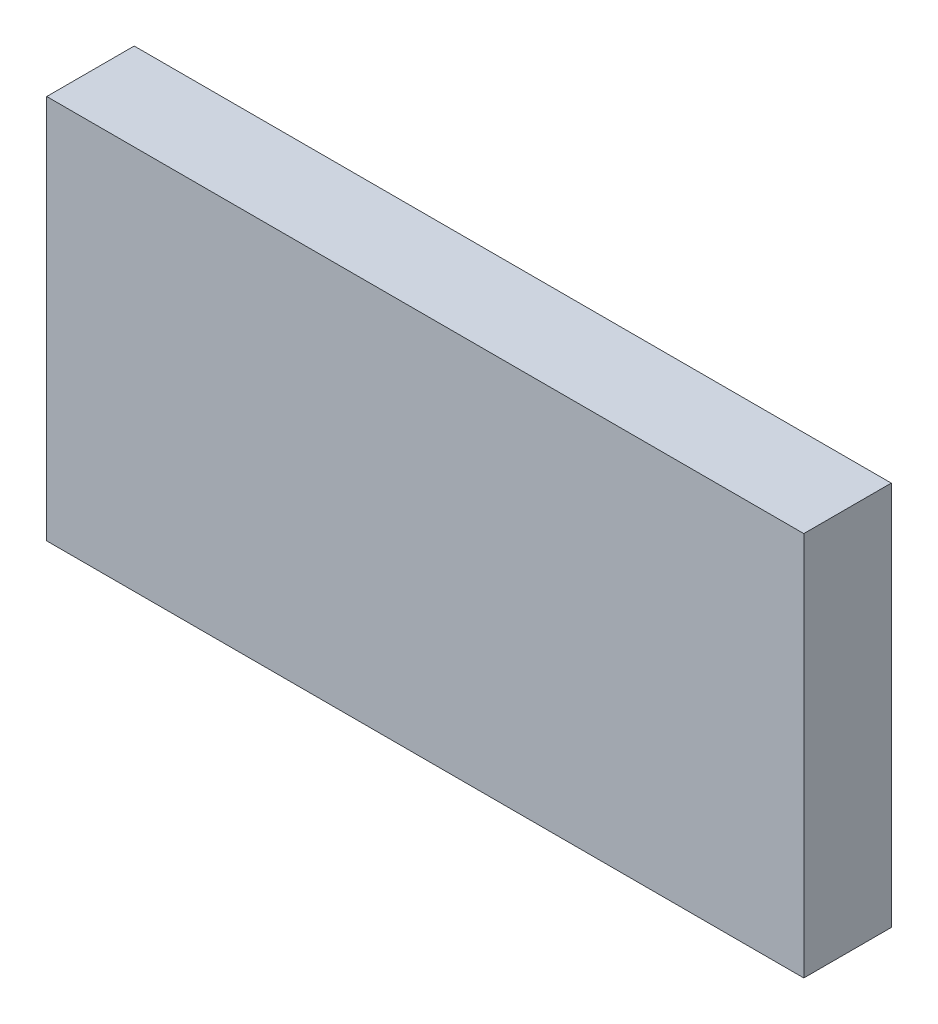
ISO-10303-21;
HEADER;
FILE_DESCRIPTION(('STEP AP214'),'2;1');
FILE_NAME('part.step','',(''),(''),'','','');
FILE_SCHEMA(('AUTOMOTIVE_DESIGN { 1 0 10303 214 1 1 1 1 }'));
ENDSEC;
DATA;
#1=APPLICATION_CONTEXT('core data for automotive mechanical design processes');
#2=APPLICATION_PROTOCOL_DEFINITION('international standard','automotive_design',2000,#1);
#3=PRODUCT_CONTEXT('',#1,'mechanical');
#4=PRODUCT('Part','Part','',(#3));
#5=PRODUCT_RELATED_PRODUCT_CATEGORY('part','',(#4));
#6=PRODUCT_DEFINITION_FORMATION('','',#4);
#7=PRODUCT_DEFINITION_CONTEXT('part definition',#1,'design');
#8=PRODUCT_DEFINITION('design','',#6,#7);
#9=PRODUCT_DEFINITION_SHAPE('','',#8);
#10=(LENGTH_UNIT() NAMED_UNIT(*) SI_UNIT(.MILLI.,.METRE.));
#11=(NAMED_UNIT(*) PLANE_ANGLE_UNIT() SI_UNIT($,.RADIAN.));
#12=(NAMED_UNIT(*) SI_UNIT($,.STERADIAN.) SOLID_ANGLE_UNIT());
#13=UNCERTAINTY_MEASURE_WITH_UNIT(LENGTH_MEASURE(1.E-05),#10,'distance_accuracy_value','');
#14=(GEOMETRIC_REPRESENTATION_CONTEXT(3) GLOBAL_UNCERTAINTY_ASSIGNED_CONTEXT((#13)) GLOBAL_UNIT_ASSIGNED_CONTEXT((#10,
#11,#12)) REPRESENTATION_CONTEXT('',''));
#15=CARTESIAN_POINT('',(0.,0.,0.));
#16=DIRECTION('',(0.,0.,1.));
#17=DIRECTION('',(1.,0.,0.));
#18=AXIS2_PLACEMENT_3D('',#15,#16,#17);
#19=CARTESIAN_POINT('',(0.5795,-0.62,0.));
#20=DIRECTION('',(1.,0.,0.));
#21=DIRECTION('',(0.,0.,1.));
#22=AXIS2_PLACEMENT_3D('',#19,#20,#21);
#23=PLANE('',#22);
#24=DIRECTION('',(0.,1.,0.));
#25=VECTOR('',#24,1.);
#26=CARTESIAN_POINT('',(0.5795,-0.62,0.1));
#27=LINE('',#26,#25);
#28=CARTESIAN_POINT('',(0.5795,-0.62,0.1));
#29=VERTEX_POINT('',#28);
#30=CARTESIAN_POINT('',(0.5795,-0.18,0.1));
#31=VERTEX_POINT('',#30);
#32=EDGE_CURVE('E11',#29,#31,#27,.T.);
#33=ORIENTED_EDGE('',*,*,#32,.T.);
#34=DIRECTION('',(0.,0.,1.));
#35=VECTOR('',#34,1.);
#36=CARTESIAN_POINT('',(0.5795,-0.18,0.));
#37=LINE('',#36,#35);
#38=CARTESIAN_POINT('',(0.5795,-0.18,0.));
#39=VERTEX_POINT('',#38);
#40=EDGE_CURVE('E24',#39,#31,#37,.T.);
#41=ORIENTED_EDGE('',*,*,#40,.F.);
#42=DIRECTION('',(0.,1.,0.));
#43=VECTOR('',#42,1.);
#44=CARTESIAN_POINT('',(0.5795,-0.62,0.));
#45=LINE('',#44,#43);
#46=CARTESIAN_POINT('',(0.5795,-0.62,0.));
#47=VERTEX_POINT('',#46);
#48=EDGE_CURVE('E86',#47,#39,#45,.T.);
#49=ORIENTED_EDGE('',*,*,#48,.F.);
#50=DIRECTION('',(0.,0.,1.));
#51=VECTOR('',#50,1.);
#52=CARTESIAN_POINT('',(0.5795,-0.62,0.));
#53=LINE('',#52,#51);
#54=EDGE_CURVE('E36',#47,#29,#53,.T.);
#55=ORIENTED_EDGE('',*,*,#54,.T.);
#56=EDGE_LOOP('',(#33,#41,#49,#55));
#57=FACE_BOUND('',#56,.T.);
#58=ADVANCED_FACE('F17',(#57),#23,.F.);
#59=CARTESIAN_POINT('',(1.445,-0.62,0.));
#60=DIRECTION('',(1.,0.,0.));
#61=DIRECTION('',(0.,0.,1.));
#62=AXIS2_PLACEMENT_3D('',#59,#60,#61);
#63=PLANE('',#62);
#64=DIRECTION('',(0.,0.,1.));
#65=VECTOR('',#64,1.);
#66=CARTESIAN_POINT('',(1.445,-0.62,0.));
#67=LINE('',#66,#65);
#68=CARTESIAN_POINT('',(1.445,-0.62,0.));
#69=VERTEX_POINT('',#68);
#70=CARTESIAN_POINT('',(1.445,-0.62,0.1));
#71=VERTEX_POINT('',#70);
#72=EDGE_CURVE('E83',#69,#71,#67,.T.);
#73=ORIENTED_EDGE('',*,*,#72,.F.);
#74=DIRECTION('',(0.,1.,0.));
#75=VECTOR('',#74,1.);
#76=CARTESIAN_POINT('',(1.445,-0.62,0.));
#77=LINE('',#76,#75);
#78=CARTESIAN_POINT('',(1.445,-0.18,0.));
#79=VERTEX_POINT('',#78);
#80=EDGE_CURVE('E63',#69,#79,#77,.T.);
#81=ORIENTED_EDGE('',*,*,#80,.T.);
#82=DIRECTION('',(0.,0.,1.));
#83=VECTOR('',#82,1.);
#84=CARTESIAN_POINT('',(1.445,-0.18,0.));
#85=LINE('',#84,#83);
#86=CARTESIAN_POINT('',(1.445,-0.18,0.1));
#87=VERTEX_POINT('',#86);
#88=EDGE_CURVE('E57',#79,#87,#85,.T.);
#89=ORIENTED_EDGE('',*,*,#88,.T.);
#90=DIRECTION('',(0.,1.,0.));
#91=VECTOR('',#90,1.);
#92=CARTESIAN_POINT('',(1.445,-0.62,0.1));
#93=LINE('',#92,#91);
#94=EDGE_CURVE('E60',#71,#87,#93,.T.);
#95=ORIENTED_EDGE('',*,*,#94,.F.);
#96=EDGE_LOOP('',(#73,#81,#89,#95));
#97=FACE_BOUND('',#96,.T.);
#98=ADVANCED_FACE('F59',(#97),#63,.T.);
#99=CARTESIAN_POINT('',(0.5795,-0.62,0.));
#100=DIRECTION('',(0.,1.,0.));
#101=DIRECTION('',(0.,0.,1.));
#102=AXIS2_PLACEMENT_3D('',#99,#100,#101);
#103=PLANE('',#102);
#104=ORIENTED_EDGE('',*,*,#72,.T.);
#105=DIRECTION('',(1.,0.,0.));
#106=VECTOR('',#105,1.);
#107=CARTESIAN_POINT('',(0.5795,-0.62,0.1));
#108=LINE('',#107,#106);
#109=EDGE_CURVE('E71',#29,#71,#108,.T.);
#110=ORIENTED_EDGE('',*,*,#109,.F.);
#111=ORIENTED_EDGE('',*,*,#54,.F.);
#112=DIRECTION('',(1.,0.,0.));
#113=VECTOR('',#112,1.);
#114=CARTESIAN_POINT('',(0.5795,-0.62,0.));
#115=LINE('',#114,#113);
#116=EDGE_CURVE('E76',#47,#69,#115,.T.);
#117=ORIENTED_EDGE('',*,*,#116,.T.);
#118=EDGE_LOOP('',(#104,#110,#111,#117));
#119=FACE_BOUND('',#118,.T.);
#120=ADVANCED_FACE('F91',(#119),#103,.F.);
#121=CARTESIAN_POINT('',(0.5795,-0.18,0.));
#122=DIRECTION('',(0.,1.,0.));
#123=DIRECTION('',(0.,0.,1.));
#124=AXIS2_PLACEMENT_3D('',#121,#122,#123);
#125=PLANE('',#124);
#126=DIRECTION('',(1.,0.,0.));
#127=VECTOR('',#126,1.);
#128=CARTESIAN_POINT('',(0.5795,-0.18,0.));
#129=LINE('',#128,#127);
#130=EDGE_CURVE('E74',#39,#79,#129,.T.);
#131=ORIENTED_EDGE('',*,*,#130,.F.);
#132=ORIENTED_EDGE('',*,*,#40,.T.);
#133=DIRECTION('',(1.,0.,0.));
#134=VECTOR('',#133,1.);
#135=CARTESIAN_POINT('',(0.5795,-0.18,0.1));
#136=LINE('',#135,#134);
#137=EDGE_CURVE('E69',#31,#87,#136,.T.);
#138=ORIENTED_EDGE('',*,*,#137,.T.);
#139=ORIENTED_EDGE('',*,*,#88,.F.);
#140=EDGE_LOOP('',(#131,#132,#138,#139));
#141=FACE_BOUND('',#140,.T.);
#142=ADVANCED_FACE('F73',(#141),#125,.T.);
#143=CARTESIAN_POINT('',(0.5795,-0.62,0.));
#144=DIRECTION('',(0.,0.,1.));
#145=DIRECTION('',(1.,0.,0.));
#146=AXIS2_PLACEMENT_3D('',#143,#144,#145);
#147=PLANE('',#146);
#148=ORIENTED_EDGE('',*,*,#130,.T.);
#149=ORIENTED_EDGE('',*,*,#80,.F.);
#150=ORIENTED_EDGE('',*,*,#116,.F.);
#151=ORIENTED_EDGE('',*,*,#48,.T.);
#152=EDGE_LOOP('',(#148,#149,#150,#151));
#153=FACE_BOUND('',#152,.T.);
#154=ADVANCED_FACE('F89',(#153),#147,.F.);
#155=CARTESIAN_POINT('',(0.5795,-0.62,0.1));
#156=DIRECTION('',(0.,0.,1.));
#157=DIRECTION('',(1.,0.,0.));
#158=AXIS2_PLACEMENT_3D('',#155,#156,#157);
#159=PLANE('',#158);
#160=ORIENTED_EDGE('',*,*,#32,.F.);
#161=ORIENTED_EDGE('',*,*,#109,.T.);
#162=ORIENTED_EDGE('',*,*,#94,.T.);
#163=ORIENTED_EDGE('',*,*,#137,.F.);
#164=EDGE_LOOP('',(#160,#161,#162,#163));
#165=FACE_BOUND('',#164,.T.);
#166=ADVANCED_FACE('F68',(#165),#159,.T.);
#167=CLOSED_SHELL('',(#58,#98,#120,#142,#154,#166));
#168=MANIFOLD_SOLID_BREP('B1',#167);
#169=ADVANCED_BREP_SHAPE_REPRESENTATION('',(#18,#168),#14);
#170=SHAPE_DEFINITION_REPRESENTATION(#9,#169);
ENDSEC;
END-ISO-10303-21;
